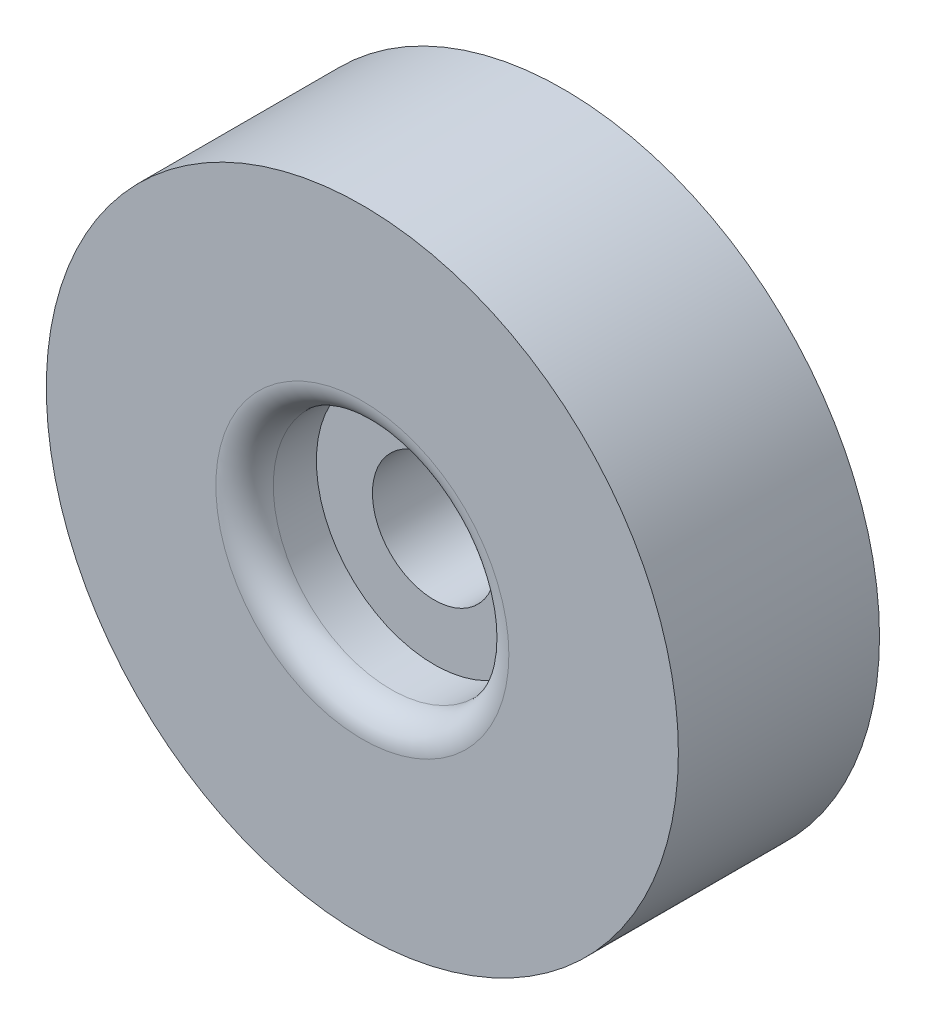
ISO-10303-21;
HEADER;
FILE_DESCRIPTION(('STEP AP214'),'2;1');
FILE_NAME('part.step','',(''),(''),'','','');
FILE_SCHEMA(('AUTOMOTIVE_DESIGN { 1 0 10303 214 1 1 1 1 }'));
ENDSEC;
DATA;
#1=APPLICATION_CONTEXT('core data for automotive mechanical design processes');
#2=APPLICATION_PROTOCOL_DEFINITION('international standard','automotive_design',2000,#1);
#3=PRODUCT_CONTEXT('',#1,'mechanical');
#4=PRODUCT('Part','Part','',(#3));
#5=PRODUCT_RELATED_PRODUCT_CATEGORY('part','',(#4));
#6=PRODUCT_DEFINITION_FORMATION('','',#4);
#7=PRODUCT_DEFINITION_CONTEXT('part definition',#1,'design');
#8=PRODUCT_DEFINITION('design','',#6,#7);
#9=PRODUCT_DEFINITION_SHAPE('','',#8);
#10=(LENGTH_UNIT() NAMED_UNIT(*) SI_UNIT(.MILLI.,.METRE.));
#11=(NAMED_UNIT(*) PLANE_ANGLE_UNIT() SI_UNIT($,.RADIAN.));
#12=(NAMED_UNIT(*) SI_UNIT($,.STERADIAN.) SOLID_ANGLE_UNIT());
#13=UNCERTAINTY_MEASURE_WITH_UNIT(LENGTH_MEASURE(1.E-05),#10,'distance_accuracy_value','');
#14=(GEOMETRIC_REPRESENTATION_CONTEXT(3) GLOBAL_UNCERTAINTY_ASSIGNED_CONTEXT((#13)) GLOBAL_UNIT_ASSIGNED_CONTEXT((#10,
#11,#12)) REPRESENTATION_CONTEXT('',''));
#15=CARTESIAN_POINT('',(0.,0.,0.));
#16=DIRECTION('',(0.,0.,1.));
#17=DIRECTION('',(1.,0.,0.));
#18=AXIS2_PLACEMENT_3D('',#15,#16,#17);
#19=CARTESIAN_POINT('',(0.,0.,7.));
#20=DIRECTION('',(0.,0.,-1.));
#21=DIRECTION('',(-1.,0.,0.));
#22=AXIS2_PLACEMENT_3D('',#19,#20,#21);
#23=CYLINDRICAL_SURFACE('',#22,11.);
#24=CARTESIAN_POINT('',(0.,0.,7.));
#25=DIRECTION('',(0.,0.,1.));
#26=DIRECTION('',(1.,0.,0.));
#27=AXIS2_PLACEMENT_3D('',#24,#25,#26);
#28=CIRCLE('',#27,11.);
#29=CARTESIAN_POINT('',(11.,0.,7.));
#30=VERTEX_POINT('',#29);
#31=EDGE_CURVE('E50',#30,#30,#28,.T.);
#32=ORIENTED_EDGE('',*,*,#31,.F.);
#33=EDGE_LOOP('',(#32));
#34=FACE_BOUND('',#33,.T.);
#35=CARTESIAN_POINT('',(0.,0.,0.));
#36=DIRECTION('',(0.,0.,1.));
#37=DIRECTION('',(1.,0.,0.));
#38=AXIS2_PLACEMENT_3D('',#35,#36,#37);
#39=CIRCLE('',#38,11.);
#40=CARTESIAN_POINT('',(11.,0.,0.));
#41=VERTEX_POINT('',#40);
#42=EDGE_CURVE('E56',#41,#41,#39,.T.);
#43=ORIENTED_EDGE('',*,*,#42,.T.);
#44=EDGE_LOOP('',(#43));
#45=FACE_BOUND('',#44,.T.);
#46=ADVANCED_FACE('F36',(#34,#45),#23,.T.);
#47=CARTESIAN_POINT('',(0.,0.,7.));
#48=DIRECTION('',(0.,0.,1.));
#49=DIRECTION('',(1.,0.,0.));
#50=AXIS2_PLACEMENT_3D('',#47,#48,#49);
#51=PLANE('',#50);
#52=CARTESIAN_POINT('',(0.,0.,7.));
#53=DIRECTION('',(0.,0.,1.));
#54=DIRECTION('',(1.,0.,0.));
#55=AXIS2_PLACEMENT_3D('',#52,#53,#54);
#56=CIRCLE('',#55,5.1);
#57=CARTESIAN_POINT('',(5.1,0.,7.));
#58=VERTEX_POINT('',#57);
#59=EDGE_CURVE('E10',#58,#58,#56,.F.);
#60=ORIENTED_EDGE('',*,*,#59,.T.);
#61=EDGE_LOOP('',(#60));
#62=FACE_BOUND('',#61,.T.);
#63=ORIENTED_EDGE('',*,*,#31,.T.);
#64=EDGE_LOOP('',(#63));
#65=FACE_BOUND('',#64,.T.);
#66=ADVANCED_FACE('F94',(#62,#65),#51,.T.);
#67=CARTESIAN_POINT('',(0.,0.,0.));
#68=DIRECTION('',(0.,0.,1.));
#69=DIRECTION('',(1.,0.,0.));
#70=AXIS2_PLACEMENT_3D('',#67,#68,#69);
#71=PLANE('',#70);
#72=CARTESIAN_POINT('',(0.,0.,0.));
#73=DIRECTION('',(0.,0.,1.));
#74=DIRECTION('',(1.,0.,0.));
#75=AXIS2_PLACEMENT_3D('',#72,#73,#74);
#76=CIRCLE('',#75,2.15);
#77=CARTESIAN_POINT('',(2.15,0.,0.));
#78=VERTEX_POINT('',#77);
#79=EDGE_CURVE('E65',#78,#78,#76,.T.);
#80=ORIENTED_EDGE('',*,*,#79,.T.);
#81=EDGE_LOOP('',(#80));
#82=FACE_BOUND('',#81,.T.);
#83=ORIENTED_EDGE('',*,*,#42,.F.);
#84=EDGE_LOOP('',(#83));
#85=FACE_BOUND('',#84,.T.);
#86=ADVANCED_FACE('F73',(#82,#85),#71,.F.);
#87=CARTESIAN_POINT('',(0.,0.,4.5));
#88=DIRECTION('',(0.,0.,1.));
#89=DIRECTION('',(1.,0.,0.));
#90=AXIS2_PLACEMENT_3D('',#87,#88,#89);
#91=CYLINDRICAL_SURFACE('',#90,4.1);
#92=CARTESIAN_POINT('',(0.,0.,6.));
#93=DIRECTION('',(0.,0.,1.));
#94=DIRECTION('',(1.,0.,0.));
#95=AXIS2_PLACEMENT_3D('',#92,#93,#94);
#96=CIRCLE('',#95,4.1);
#97=CARTESIAN_POINT('',(4.1,0.,6.));
#98=VERTEX_POINT('',#97);
#99=EDGE_CURVE('E44',#98,#98,#96,.T.);
#100=ORIENTED_EDGE('',*,*,#99,.T.);
#101=EDGE_LOOP('',(#100));
#102=FACE_BOUND('',#101,.T.);
#103=CARTESIAN_POINT('',(0.,0.,4.5));
#104=DIRECTION('',(0.,0.,1.));
#105=DIRECTION('',(1.,0.,0.));
#106=AXIS2_PLACEMENT_3D('',#103,#104,#105);
#107=CIRCLE('',#106,4.1);
#108=CARTESIAN_POINT('',(4.1,0.,4.5));
#109=VERTEX_POINT('',#108);
#110=EDGE_CURVE('E61',#109,#109,#107,.T.);
#111=ORIENTED_EDGE('',*,*,#110,.F.);
#112=EDGE_LOOP('',(#111));
#113=FACE_BOUND('',#112,.T.);
#114=ADVANCED_FACE('F85',(#102,#113),#91,.F.);
#115=CARTESIAN_POINT('',(0.,0.,4.5));
#116=DIRECTION('',(0.,0.,1.));
#117=DIRECTION('',(1.,0.,0.));
#118=AXIS2_PLACEMENT_3D('',#115,#116,#117);
#119=PLANE('',#118);
#120=CARTESIAN_POINT('',(0.,0.,4.5));
#121=DIRECTION('',(0.,0.,1.));
#122=DIRECTION('',(1.,0.,0.));
#123=AXIS2_PLACEMENT_3D('',#120,#121,#122);
#124=CIRCLE('',#123,2.15);
#125=CARTESIAN_POINT('',(2.15,0.,4.5));
#126=VERTEX_POINT('',#125);
#127=EDGE_CURVE('E66',#126,#126,#124,.T.);
#128=ORIENTED_EDGE('',*,*,#127,.F.);
#129=EDGE_LOOP('',(#128));
#130=FACE_BOUND('',#129,.T.);
#131=ORIENTED_EDGE('',*,*,#110,.T.);
#132=EDGE_LOOP('',(#131));
#133=FACE_BOUND('',#132,.T.);
#134=ADVANCED_FACE('F79',(#130,#133),#119,.T.);
#135=CARTESIAN_POINT('',(0.,0.,0.));
#136=DIRECTION('',(0.,0.,1.));
#137=DIRECTION('',(1.,0.,0.));
#138=AXIS2_PLACEMENT_3D('',#135,#136,#137);
#139=CYLINDRICAL_SURFACE('',#138,2.15);
#140=ORIENTED_EDGE('',*,*,#79,.F.);
#141=EDGE_LOOP('',(#140));
#142=FACE_BOUND('',#141,.T.);
#143=ORIENTED_EDGE('',*,*,#127,.T.);
#144=EDGE_LOOP('',(#143));
#145=FACE_BOUND('',#144,.T.);
#146=ADVANCED_FACE('F76',(#142,#145),#139,.F.);
#147=CARTESIAN_POINT('',(0.,0.,6.));
#148=DIRECTION('',(0.,0.,1.));
#149=DIRECTION('',(1.,0.,0.));
#150=AXIS2_PLACEMENT_3D('',#147,#148,#149);
#151=TOROIDAL_SURFACE('',#150,5.1,1.);
#152=ORIENTED_EDGE('',*,*,#59,.F.);
#153=EDGE_LOOP('',(#152));
#154=FACE_BOUND('',#153,.T.);
#155=ORIENTED_EDGE('',*,*,#99,.F.);
#156=EDGE_LOOP('',(#155));
#157=FACE_BOUND('',#156,.T.);
#158=ADVANCED_FACE('F38',(#154,#157),#151,.T.);
#159=CLOSED_SHELL('',(#46,#66,#86,#114,#134,#146,#158));
#160=MANIFOLD_SOLID_BREP('B2',#159);
#161=ADVANCED_BREP_SHAPE_REPRESENTATION('',(#18,#160),#14);
#162=SHAPE_DEFINITION_REPRESENTATION(#9,#161);
ENDSEC;
END-ISO-10303-21;
